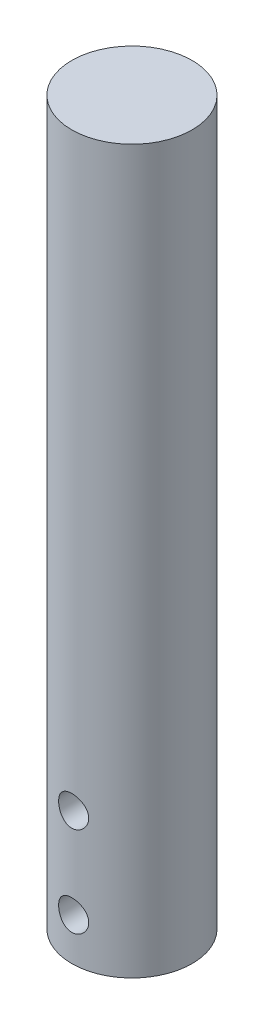
ISO-10303-21;
HEADER;
FILE_DESCRIPTION(('STEP AP214'),'2;1');
FILE_NAME('part.step','',(''),(''),'','','');
FILE_SCHEMA(('AUTOMOTIVE_DESIGN { 1 0 10303 214 1 1 1 1 }'));
ENDSEC;
DATA;
#1=APPLICATION_CONTEXT('core data for automotive mechanical design processes');
#2=APPLICATION_PROTOCOL_DEFINITION('international standard','automotive_design',2000,#1);
#3=PRODUCT_CONTEXT('',#1,'mechanical');
#4=PRODUCT('Part','Part','',(#3));
#5=PRODUCT_RELATED_PRODUCT_CATEGORY('part','',(#4));
#6=PRODUCT_DEFINITION_FORMATION('','',#4);
#7=PRODUCT_DEFINITION_CONTEXT('part definition',#1,'design');
#8=PRODUCT_DEFINITION('design','',#6,#7);
#9=PRODUCT_DEFINITION_SHAPE('','',#8);
#10=(LENGTH_UNIT() NAMED_UNIT(*) SI_UNIT(.MILLI.,.METRE.));
#11=(NAMED_UNIT(*) PLANE_ANGLE_UNIT() SI_UNIT($,.RADIAN.));
#12=(NAMED_UNIT(*) SI_UNIT($,.STERADIAN.) SOLID_ANGLE_UNIT());
#13=UNCERTAINTY_MEASURE_WITH_UNIT(LENGTH_MEASURE(1.E-05),#10,'distance_accuracy_value','');
#14=(GEOMETRIC_REPRESENTATION_CONTEXT(3) GLOBAL_UNCERTAINTY_ASSIGNED_CONTEXT((#13)) GLOBAL_UNIT_ASSIGNED_CONTEXT((#10,
#11,#12)) REPRESENTATION_CONTEXT('',''));
#15=CARTESIAN_POINT('',(0.,0.,0.));
#16=DIRECTION('',(0.,0.,1.));
#17=DIRECTION('',(1.,0.,0.));
#18=AXIS2_PLACEMENT_3D('',#15,#16,#17);
#19=CARTESIAN_POINT('',(0.,152.4,0.));
#20=DIRECTION('',(0.,-1.,0.));
#21=DIRECTION('',(0.,0.,-1.));
#22=AXIS2_PLACEMENT_3D('',#19,#20,#21);
#23=CYLINDRICAL_SURFACE('',#22,12.7);
#24=CARTESIAN_POINT('',(0.,12.065,-12.7));
#25=CARTESIAN_POINT('',(-0.175421054350929,12.0649950771876,-12.6999970338729));
#26=CARTESIAN_POINT('',(-0.350897100741778,12.0504128841955,-12.6963292371237));
#27=CARTESIAN_POINT('',(-0.696820051980957,11.9925567630668,-12.6820530760661));
#28=CARTESIAN_POINT('',(-0.86726404920973,11.9492665731449,-12.6714407780562));
#29=CARTESIAN_POINT('',(-1.19807751278645,11.8354702468386,-12.6444507573614));
#30=CARTESIAN_POINT('',(-1.35845880926017,11.7649967927193,-12.6280799601569));
#31=CARTESIAN_POINT('',(-1.66512267919771,11.5989493910717,-12.591316443928));
#32=CARTESIAN_POINT('',(-1.81140477687155,11.5033745968815,-12.5709235892463));
#33=CARTESIAN_POINT('',(-2.08873074612027,11.2877583285653,-12.5278602543575));
#34=CARTESIAN_POINT('',(-2.2194428772959,11.1672971663367,-12.5051546346353));
#35=CARTESIAN_POINT('',(-2.45903522924702,10.9062261662759,-12.4602582924963));
#36=CARTESIAN_POINT('',(-2.56791298487579,10.765614056429,-12.4380676284689));
#37=CARTESIAN_POINT('',(-2.76230618225783,10.4656567700734,-12.3963594189446));
#38=CARTESIAN_POINT('',(-2.84745052370821,10.3060643281215,-12.3768864828385));
#39=CARTESIAN_POINT('',(-2.98957345643241,9.97426586198626,-12.343330973648));
#40=CARTESIAN_POINT('',(-3.04655655068163,9.80206185944723,-12.3292475388652));
#41=CARTESIAN_POINT('',(-3.12960773790342,9.45357626213982,-12.3084267567388));
#42=CARTESIAN_POINT('',(-3.15627230130285,9.27744547005292,-12.3015478927701));
#43=CARTESIAN_POINT('',(-3.17978742389056,8.92308652895139,-12.2954915053947));
#44=CARTESIAN_POINT('',(-3.176642833515,8.74485872586831,-12.2963127290578));
#45=CARTESIAN_POINT('',(-3.14110481048737,8.39593654027233,-12.3054365167726));
#46=CARTESIAN_POINT('',(-3.10942215340351,8.22516426789838,-12.3135572669877));
#47=CARTESIAN_POINT('',(-3.01884119561133,7.89143910890492,-12.3360753547043));
#48=CARTESIAN_POINT('',(-2.95994095604688,7.72848678025545,-12.3504731393489));
#49=CARTESIAN_POINT('',(-2.81599106163371,7.41312119893299,-12.3840899110031));
#50=CARTESIAN_POINT('',(-2.73068344564301,7.26083093637874,-12.4033560981111));
#51=CARTESIAN_POINT('',(-2.53652078423163,6.97247206434806,-12.4445122129068));
#52=CARTESIAN_POINT('',(-2.42766161831204,6.83640629992432,-12.4664025994163));
#53=CARTESIAN_POINT('',(-2.18580424890858,6.58028568011351,-12.5111061380944));
#54=CARTESIAN_POINT('',(-2.05220624645107,6.46079799603681,-12.533927803951));
#55=CARTESIAN_POINT('',(-1.76659522538283,6.24581503678474,-12.5773596047503));
#56=CARTESIAN_POINT('',(-1.61458164448181,6.15032049447545,-12.5979696721291));
#57=CARTESIAN_POINT('',(-1.29564529770895,5.98582625915838,-12.6347586626604));
#58=CARTESIAN_POINT('',(-1.12867311562492,5.91691869646146,-12.6509221227036));
#59=CARTESIAN_POINT('',(-0.785020883902435,5.8083083695814,-12.676884242985));
#60=CARTESIAN_POINT('',(-0.608342698201859,5.76860001891494,-12.6866841206814));
#61=CARTESIAN_POINT('',(-0.255142937325557,5.72038148623379,-12.6986347345774));
#62=CARTESIAN_POINT('',(-0.0787330573083777,5.71109892814061,-12.7009747992585));
#63=CARTESIAN_POINT('',(0.273119584996527,5.72187705435078,-12.6982813685726));
#64=CARTESIAN_POINT('',(0.448562432914396,5.74193509725817,-12.6932485369526));
#65=CARTESIAN_POINT('',(0.79081686891024,5.81018842276175,-12.6764961338623));
#66=CARTESIAN_POINT('',(0.957717835150523,5.85796234102626,-12.6648767569325));
#67=CARTESIAN_POINT('',(1.28112793569116,5.97980999452691,-12.6362609570897));
#68=CARTESIAN_POINT('',(1.43763601861911,6.05388638579632,-12.6192639911647));
#69=CARTESIAN_POINT('',(1.73889063454314,6.2277331394514,-12.5813250177716));
#70=CARTESIAN_POINT('',(1.88337918521904,6.32793610457274,-12.5603183592593));
#71=CARTESIAN_POINT('',(2.15376466554501,6.55063864028733,-12.5167921111412));
#72=CARTESIAN_POINT('',(2.27965837982672,6.67314205885732,-12.4942722608556));
#73=CARTESIAN_POINT('',(2.51246336908675,6.94055415045254,-12.4495762556412));
#74=CARTESIAN_POINT('',(2.6188328531313,7.08593897134918,-12.4274221051899));
#75=CARTESIAN_POINT('',(2.80566443991221,7.39295074295838,-12.3865825924258));
#76=CARTESIAN_POINT('',(2.88612769264178,7.554576972287,-12.3678970761538));
#77=CARTESIAN_POINT('',(3.0182638402854,7.88861711242697,-12.3363163381503));
#78=CARTESIAN_POINT('',(3.07010730622843,8.06096014659597,-12.3233869021911));
#79=CARTESIAN_POINT('',(3.14398164687971,8.41228873345877,-12.3047494152553));
#80=CARTESIAN_POINT('',(3.16601904149253,8.59127282465607,-12.299039785006));
#81=CARTESIAN_POINT('',(3.17931501621074,8.9452895005204,-12.2956087422145));
#82=CARTESIAN_POINT('',(3.17143955029538,9.12028790438749,-12.2976625750886));
#83=CARTESIAN_POINT('',(3.1271152390873,9.46637656437626,-12.3090074061494));
#84=CARTESIAN_POINT('',(3.09066696801937,9.6374668989669,-12.3182982588945));
#85=CARTESIAN_POINT('',(2.9907046261569,9.96994123834368,-12.3429450180984));
#86=CARTESIAN_POINT('',(2.92735297324093,10.1313769627554,-12.3582644892528));
#87=CARTESIAN_POINT('',(2.7755107337966,10.4414433934137,-12.3932474960913));
#88=CARTESIAN_POINT('',(2.68701666057215,10.5900723199131,-12.4129116342002));
#89=CARTESIAN_POINT('',(2.48468673461549,10.8744906313868,-12.4550092586011));
#90=CARTESIAN_POINT('',(2.37025002816433,11.0098439387471,-12.4775016056118));
#91=CARTESIAN_POINT('',(2.12045416901821,11.2597079114838,-12.5223699100401));
#92=CARTESIAN_POINT('',(1.98509005500274,11.3742136204058,-12.5447458385544));
#93=CARTESIAN_POINT('',(1.6943230585205,11.5811539364617,-12.5873437112106));
#94=CARTESIAN_POINT('',(1.53860166056969,11.6731512656048,-12.6075193062447));
#95=CARTESIAN_POINT('',(1.21341315929717,11.8295154632241,-12.6429542453062));
#96=CARTESIAN_POINT('',(1.04395600927443,11.8939021300394,-12.6582171100619));
#97=CARTESIAN_POINT('',(0.729001702698678,11.9836603741978,-12.6798505941374));
#98=CARTESIAN_POINT('',(0.585004695088741,12.0140967977964,-12.6873547169486));
#99=CARTESIAN_POINT('',(0.294017851418463,12.0547679139998,-12.6974304774096));
#100=CARTESIAN_POINT('',(0.14702824129687,12.0650041260296,-12.7000024860439));
#101=CARTESIAN_POINT('',(0.,12.065,-12.7));
#102=B_SPLINE_CURVE_WITH_KNOTS('',3,(#24,#25,#26,#27,#28,#29,#30,#31,#32,#33,#34,#35,#36,#37,
#38,#39,#40,#41,#42,#43,#44,#45,#46,#47,#48,#49,#50,#51,#52,#53,#54,#55,#56,#57,#58,#59,#60,#61,
#62,#63,#64,#65,#66,#67,#68,#69,#70,#71,#72,#73,#74,#75,#76,#77,#78,#79,#80,#81,#82,#83,#84,#85,
#86,#87,#88,#89,#90,#91,#92,#93,#94,#95,#96,#97,#98,#99,#100,#101),.UNSPECIFIED.,.T.,.F.,(4,2,2,
2,2,2,2,2,2,2,2,2,2,2,2,2,2,2,2,2,2,2,2,2,2,2,2,2,2,2,2,2,2,2,2,2,2,2,4),(0.,0.525724358065498,
1.05174676993359,1.57713870983893,2.10254837335841,2.63767221675278,3.17285644277798,
3.71599137305291,4.25903942808497,4.79120824630598,5.32329047345571,5.84247618671884,
6.36169889010144,6.8861628400674,7.41071862276907,7.9502317705812,8.48976139571985,
9.0311441807632,9.57242335981323,10.09985087283,10.6272309069567,11.1467958106174,
11.6664131950588,12.1952509368702,12.7241800170734,13.266092111565,13.8079801469349,
14.34660272276,14.8851074589671,15.4081433519175,15.9311687337377,16.4510804786766,
16.9710643590661,17.5046127008448,18.0382877269755,18.5816279265763,19.1245778677202,
19.5652441424438,20.005877269746),.UNSPECIFIED.);
#103=CARTESIAN_POINT('',(0.,12.065,-12.7));
#104=VERTEX_POINT('',#103);
#105=EDGE_CURVE('E10',#104,#104,#102,.T.);
#106=ORIENTED_EDGE('',*,*,#105,.T.);
#107=EDGE_LOOP('',(#106));
#108=FACE_BOUND('',#107,.T.);
#109=CARTESIAN_POINT('',(3.175,8.89,12.2967221242086));
#110=CARTESIAN_POINT('',(3.1749950198132,8.71467554632325,12.2967254711158));
#111=CARTESIAN_POINT('',(3.16042833178202,8.53929597867828,12.3005126863854));
#112=CARTESIAN_POINT('',(3.10263936933902,8.19357317571964,12.3152136473056));
#113=CARTESIAN_POINT('',(3.05940041756247,8.0232329318254,12.3261315404947));
#114=CARTESIAN_POINT('',(2.94575382353269,7.69263950650228,12.3537818023711));
#115=CARTESIAN_POINT('',(2.8753812543752,7.53237361266015,12.3705066621688));
#116=CARTESIAN_POINT('',(2.70957184940196,7.22590521727435,12.4078770387652));
#117=CARTESIAN_POINT('',(2.61413394947207,7.07970331315812,12.4285227220068));
#118=CARTESIAN_POINT('',(2.39865970268609,6.80229571051699,12.4719170977164));
#119=CARTESIAN_POINT('',(2.27817284738415,6.67144512755544,12.4946993898125));
#120=CARTESIAN_POINT('',(2.01699122140784,6.43158302916237,12.5395085190442));
#121=CARTESIAN_POINT('',(1.87629456360899,6.32257355546038,12.5615352853931));
#122=CARTESIAN_POINT('',(1.57625440537028,6.12803515610828,12.6027232771114));
#123=CARTESIAN_POINT('',(1.41667811176781,6.04285508703494,12.6218402299875));
#124=CARTESIAN_POINT('',(1.08491424405181,5.90066175192559,12.65467131146));
#125=CARTESIAN_POINT('',(0.912728534955768,5.8436443300673,12.6683862371462));
#126=CARTESIAN_POINT('',(0.56433562361779,5.7605322500852,12.6886304373719));
#127=CARTESIAN_POINT('',(0.388280553827203,5.73383455170524,12.6952996518228));
#128=CARTESIAN_POINT('',(0.0340726004637216,5.71022685832005,12.7011886451627));
#129=CARTESIAN_POINT('',(-0.144079969063343,5.71331245929381,12.7004095254282));
#130=CARTESIAN_POINT('',(-0.493243384772326,5.74875005981768,12.6915938059099));
#131=CARTESIAN_POINT('',(-0.664324984533384,5.7804511328184,12.6837186297291));
#132=CARTESIAN_POINT('',(-0.998658935538451,5.87117351296159,12.6617836238657));
#133=CARTESIAN_POINT('',(-1.16191086950114,5.93019627442931,12.6477234649603));
#134=CARTESIAN_POINT('',(-1.47766628361823,6.07441326477257,12.6147513732012));
#135=CARTESIAN_POINT('',(-1.63005931850865,6.15983914672041,12.5957967501266));
#136=CARTESIAN_POINT('',(-1.91857510093105,6.35426171247765,12.5550917783831));
#137=CARTESIAN_POINT('',(-2.05469501139648,6.46326249707199,12.5333409435887));
#138=CARTESIAN_POINT('',(-2.31068256139473,6.70523010231761,12.4887191648708));
#139=CARTESIAN_POINT('',(-2.43001063106375,6.83876571328163,12.4658338379713));
#140=CARTESIAN_POINT('',(-2.64469999368259,7.12419196639615,12.4220610526701));
#141=CARTESIAN_POINT('',(-2.74006016644614,7.2760834659537,12.4011736876753));
#142=CARTESIAN_POINT('',(-2.90445230964671,7.59496834336905,12.3637103097324));
#143=CARTESIAN_POINT('',(-2.97335437513118,7.76203137749726,12.347155693206));
#144=CARTESIAN_POINT('',(-3.08192684552051,8.10588354445759,12.3205067298881));
#145=CARTESIAN_POINT('',(-3.12160350580598,8.28267058726043,12.3104110007027));
#146=CARTESIAN_POINT('',(-3.16970364110572,8.63594856694299,12.2981130212947));
#147=CARTESIAN_POINT('',(-3.17892490187728,8.8123239975431,12.2957093300071));
#148=CARTESIAN_POINT('',(-3.16803657795425,9.16409385946326,12.2985192607316));
#149=CARTESIAN_POINT('',(-3.14792969326925,9.33948837959578,12.3037321815428));
#150=CARTESIAN_POINT('',(-3.07965533920158,9.68135511648468,12.3209949412092));
#151=CARTESIAN_POINT('',(-3.03195236671802,9.84792636274288,12.3329315220802));
#152=CARTESIAN_POINT('',(-2.91035496372149,10.1707079514737,12.3621891219376));
#153=CARTESIAN_POINT('',(-2.83645743059488,10.3269170640008,12.3795107787294));
#154=CARTESIAN_POINT('',(-2.66289874827949,10.627920422891,12.418010941113));
#155=CARTESIAN_POINT('',(-2.56276062737127,10.7724306268546,12.439258441312));
#156=CARTESIAN_POINT('',(-2.34016643006689,11.0428892207579,12.4830469550031));
#157=CARTESIAN_POINT('',(-2.21770668600727,11.1688345541456,12.5055881806495));
#158=CARTESIAN_POINT('',(-1.95028413912651,11.4018200240651,12.5501070185035));
#159=CARTESIAN_POINT('',(-1.80483494928781,11.508308279437,12.5720564161859));
#160=CARTESIAN_POINT('',(-1.4976560175556,11.6953485510281,12.6123346509939));
#161=CARTESIAN_POINT('',(-1.33592712544035,11.7759019200924,12.6306636769502));
#162=CARTESIAN_POINT('',(-1.00189729049622,11.9080864638505,12.6615204698767));
#163=CARTESIAN_POINT('',(-0.829682684763529,11.9599256411614,12.6740898412846));
#164=CARTESIAN_POINT('',(-0.478630489012215,12.0338346249527,12.6921932261265));
#165=CARTESIAN_POINT('',(-0.299794184005942,12.0559101765986,12.6977285972965));
#166=CARTESIAN_POINT('',(0.0542401964575483,12.0693420969023,12.7010848787296));
#167=CARTESIAN_POINT('',(0.229405900617116,12.0615129263779,12.6991103294396));
#168=CARTESIAN_POINT('',(0.575841801116831,12.0172231483404,12.6881222125238));
#169=CARTESIAN_POINT('',(0.747112113154445,11.9807633923332,12.6791088542401));
#170=CARTESIAN_POINT('',(1.08004303817215,11.8806842022275,12.655087493111));
#171=CARTESIAN_POINT('',(1.24175042029423,11.8172120357268,12.640112022951));
#172=CARTESIAN_POINT('',(1.55231164340715,11.6650434116129,12.6057434230086));
#173=CARTESIAN_POINT('',(1.70116386101838,11.5763437742712,12.5863497364056));
#174=CARTESIAN_POINT('',(1.98565112274398,11.3737541320623,12.5446551773491));
#175=CARTESIAN_POINT('',(2.12088408784721,11.2593115462803,12.5222957878979));
#176=CARTESIAN_POINT('',(2.37050268936837,11.0095574449719,12.4774531075658));
#177=CARTESIAN_POINT('',(2.48488303211817,10.8742406463471,12.4549697867119));
#178=CARTESIAN_POINT('',(2.69164443404806,10.5835405099485,12.4119473580947));
#179=CARTESIAN_POINT('',(2.783575266647,10.4278299083153,12.3914523466269));
#180=CARTESIAN_POINT('',(2.93981789665886,10.1026738196475,12.3553205869608));
#181=CARTESIAN_POINT('',(3.00414978846308,9.93323843265204,12.3396803064045));
#182=CARTESIAN_POINT('',(3.09379152821293,9.61841798742337,12.3174731028359));
#183=CARTESIAN_POINT('',(3.12417831664509,9.47453920307402,12.3097500503611));
#184=CARTESIAN_POINT('',(3.16478377891537,9.18378634093234,12.2993733749982));
#185=CARTESIAN_POINT('',(3.17500417313031,9.03691251972402,12.2967193196792));
#186=CARTESIAN_POINT('',(3.175,8.89,12.2967221242086));
#187=B_SPLINE_CURVE_WITH_KNOTS('',3,(#109,#110,#111,#112,#113,#114,#115,#116,#117,#118,#119,
#120,#121,#122,#123,#124,#125,#126,#127,#128,#129,#130,#131,#132,#133,#134,#135,#136,#137,#138,
#139,#140,#141,#142,#143,#144,#145,#146,#147,#148,#149,#150,#151,#152,#153,#154,#155,#156,#157,
#158,#159,#160,#161,#162,#163,#164,#165,#166,#167,#168,#169,#170,#171,#172,#173,#174,#175,#176,
#177,#178,#179,#180,#181,#182,#183,#184,#185,#186),.UNSPECIFIED.,.T.,.F.,(4,2,2,2,2,2,2,2,2,2,2,
2,2,2,2,2,2,2,2,2,2,2,2,2,2,2,2,2,2,2,2,2,2,2,2,2,2,2,4),(0.,0.525433851004891,1.05117359161441,
1.57623602350085,2.10132074979458,2.63682421825079,3.1723777227943,3.71540400425358,
4.25835013005807,4.79029713764089,5.32216548805845,5.84223193614962,6.36232607040478,
6.88711950303144,7.41200429545519,7.95109492546327,8.49021074623748,9.03194068650671,
9.57355464164525,10.1008633995054,10.6281236152971,11.1467570436797,11.6654519221148,
12.1943221424741,12.7232793399029,13.2654717033223,13.8076357797011,14.3458193247108,
14.8838989712076,15.4074297658815,15.9309449907505,16.4516419323711,16.9724045329363,
17.5056431266551,18.0390169009448,18.5823412615974,19.1252693614627,19.5655924052587,
20.0058778838705),.UNSPECIFIED.);
#188=CARTESIAN_POINT('',(3.175,8.89,12.2967221242086));
#189=VERTEX_POINT('',#188);
#190=EDGE_CURVE('E41',#189,#189,#187,.T.);
#191=ORIENTED_EDGE('',*,*,#190,.T.);
#192=EDGE_LOOP('',(#191));
#193=FACE_BOUND('',#192,.T.);
#194=CARTESIAN_POINT('',(0.,31.115,-12.7));
#195=CARTESIAN_POINT('',(-0.175421054350931,31.1149950771876,-12.6999970338729));
#196=CARTESIAN_POINT('',(-0.350897100741782,31.1004128841955,-12.6963292371237));
#197=CARTESIAN_POINT('',(-0.696820051980961,31.0425567630668,-12.6820530760661));
#198=CARTESIAN_POINT('',(-0.867264049209732,30.9992665731449,-12.6714407780562));
#199=CARTESIAN_POINT('',(-1.19807751278645,30.8854702468386,-12.6444507573614));
#200=CARTESIAN_POINT('',(-1.35845880926017,30.8149967927193,-12.6280799601569));
#201=CARTESIAN_POINT('',(-1.6651226791977,30.6489493910718,-12.591316443928));
#202=CARTESIAN_POINT('',(-1.81140477687155,30.5533745968815,-12.5709235892463));
#203=CARTESIAN_POINT('',(-2.08873074612027,30.3377583285653,-12.5278602543575));
#204=CARTESIAN_POINT('',(-2.2194428772959,30.2172971663367,-12.5051546346353));
#205=CARTESIAN_POINT('',(-2.45903522924702,29.9562261662759,-12.4602582924963));
#206=CARTESIAN_POINT('',(-2.56791298487579,29.815614056429,-12.4380676284689));
#207=CARTESIAN_POINT('',(-2.76230618225783,29.5156567700734,-12.3963594189446));
#208=CARTESIAN_POINT('',(-2.84745052370821,29.3560643281215,-12.3768864828385));
#209=CARTESIAN_POINT('',(-2.98957345643241,29.0242658619863,-12.343330973648));
#210=CARTESIAN_POINT('',(-3.04655655068163,28.8520618594472,-12.3292475388652));
#211=CARTESIAN_POINT('',(-3.12960773790342,28.5035762621398,-12.3084267567388));
#212=CARTESIAN_POINT('',(-3.15627230130284,28.3274454700529,-12.3015478927701));
#213=CARTESIAN_POINT('',(-3.17978742389056,27.9730865289514,-12.2954915053947));
#214=CARTESIAN_POINT('',(-3.176642833515,27.7948587258683,-12.2963127290578));
#215=CARTESIAN_POINT('',(-3.14110481048737,27.4459365402723,-12.3054365167726));
#216=CARTESIAN_POINT('',(-3.10942215340351,27.2751642678984,-12.3135572669877));
#217=CARTESIAN_POINT('',(-3.01884119561133,26.9414391089049,-12.3360753547043));
#218=CARTESIAN_POINT('',(-2.95994095604688,26.7784867802555,-12.3504731393489));
#219=CARTESIAN_POINT('',(-2.81599106163371,26.463121198933,-12.3840899110031));
#220=CARTESIAN_POINT('',(-2.73068344564301,26.3108309363787,-12.4033560981111));
#221=CARTESIAN_POINT('',(-2.53652078423164,26.0224720643481,-12.4445122129068));
#222=CARTESIAN_POINT('',(-2.42766161831204,25.8864062999243,-12.4664025994163));
#223=CARTESIAN_POINT('',(-2.18580424890858,25.6302856801135,-12.5111061380944));
#224=CARTESIAN_POINT('',(-2.05220624645107,25.5107979960368,-12.533927803951));
#225=CARTESIAN_POINT('',(-1.76659522538283,25.2958150367847,-12.5773596047503));
#226=CARTESIAN_POINT('',(-1.61458164448182,25.2003204944755,-12.5979696721291));
#227=CARTESIAN_POINT('',(-1.29564529770895,25.0358262591584,-12.6347586626604));
#228=CARTESIAN_POINT('',(-1.12867311562492,24.9669186964615,-12.6509221227036));
#229=CARTESIAN_POINT('',(-0.785020883902437,24.8583083695814,-12.676884242985));
#230=CARTESIAN_POINT('',(-0.608342698201861,24.8186000189149,-12.6866841206814));
#231=CARTESIAN_POINT('',(-0.255142937325558,24.7703814862338,-12.6986347345774));
#232=CARTESIAN_POINT('',(-0.0787330573083791,24.7610989281406,-12.7009747992585));
#233=CARTESIAN_POINT('',(0.273119584996525,24.7718770543508,-12.6982813685726));
#234=CARTESIAN_POINT('',(0.448562432914395,24.7919350972582,-12.6932485369526));
#235=CARTESIAN_POINT('',(0.790816868910238,24.8601884227617,-12.6764961338623));
#236=CARTESIAN_POINT('',(0.957717835150521,24.9079623410263,-12.6648767569325));
#237=CARTESIAN_POINT('',(1.28112793569116,25.0298099945269,-12.6362609570897));
#238=CARTESIAN_POINT('',(1.43763601861911,25.1038863857963,-12.6192639911647));
#239=CARTESIAN_POINT('',(1.73889063454314,25.2777331394514,-12.5813250177716));
#240=CARTESIAN_POINT('',(1.88337918521904,25.3779361045727,-12.5603183592593));
#241=CARTESIAN_POINT('',(2.15376466554501,25.6006386402873,-12.5167921111412));
#242=CARTESIAN_POINT('',(2.27965837982672,25.7231420588573,-12.4942722608556));
#243=CARTESIAN_POINT('',(2.51246336908675,25.9905541504525,-12.4495762556412));
#244=CARTESIAN_POINT('',(2.6188328531313,26.1359389713492,-12.4274221051899));
#245=CARTESIAN_POINT('',(2.80566443991221,26.4429507429584,-12.3865825924258));
#246=CARTESIAN_POINT('',(2.88612769264178,26.604576972287,-12.3678970761538));
#247=CARTESIAN_POINT('',(3.0182638402854,26.938617112427,-12.3363163381503));
#248=CARTESIAN_POINT('',(3.07010730622843,27.110960146596,-12.3233869021911));
#249=CARTESIAN_POINT('',(3.14398164687971,27.4622887334588,-12.3047494152553));
#250=CARTESIAN_POINT('',(3.16601904149253,27.6412728246561,-12.299039785006));
#251=CARTESIAN_POINT('',(3.17931501621074,27.9952895005204,-12.2956087422145));
#252=CARTESIAN_POINT('',(3.17143955029538,28.1702879043875,-12.2976625750886));
#253=CARTESIAN_POINT('',(3.1271152390873,28.5163765643763,-12.3090074061494));
#254=CARTESIAN_POINT('',(3.09066696801937,28.6874668989669,-12.3182982588945));
#255=CARTESIAN_POINT('',(2.9907046261569,29.0199412383437,-12.3429450180984));
#256=CARTESIAN_POINT('',(2.92735297324093,29.1813769627554,-12.3582644892528));
#257=CARTESIAN_POINT('',(2.7755107337966,29.4914433934137,-12.3932474960913));
#258=CARTESIAN_POINT('',(2.68701666057215,29.6400723199131,-12.4129116342002));
#259=CARTESIAN_POINT('',(2.48468673461549,29.9244906313868,-12.4550092586011));
#260=CARTESIAN_POINT('',(2.37025002816433,30.0598439387472,-12.4775016056118));
#261=CARTESIAN_POINT('',(2.12045416901821,30.3097079114838,-12.5223699100401));
#262=CARTESIAN_POINT('',(1.98509005500274,30.4242136204058,-12.5447458385544));
#263=CARTESIAN_POINT('',(1.6943230585205,30.6311539364617,-12.5873437112106));
#264=CARTESIAN_POINT('',(1.53860166056969,30.7231512656048,-12.6075193062447));
#265=CARTESIAN_POINT('',(1.21341315929717,30.8795154632241,-12.6429542453062));
#266=CARTESIAN_POINT('',(1.04395600927443,30.9439021300394,-12.6582171100619));
#267=CARTESIAN_POINT('',(0.72900170269868,31.0336603741978,-12.6798505941374));
#268=CARTESIAN_POINT('',(0.585004695088744,31.0640967977964,-12.6873547169486));
#269=CARTESIAN_POINT('',(0.294017851418466,31.1047679139998,-12.6974304774096));
#270=CARTESIAN_POINT('',(0.147028241296871,31.1150041260296,-12.7000024860439));
#271=CARTESIAN_POINT('',(0.,31.115,-12.7));
#272=B_SPLINE_CURVE_WITH_KNOTS('',3,(#194,#195,#196,#197,#198,#199,#200,#201,#202,#203,#204,
#205,#206,#207,#208,#209,#210,#211,#212,#213,#214,#215,#216,#217,#218,#219,#220,#221,#222,#223,
#224,#225,#226,#227,#228,#229,#230,#231,#232,#233,#234,#235,#236,#237,#238,#239,#240,#241,#242,
#243,#244,#245,#246,#247,#248,#249,#250,#251,#252,#253,#254,#255,#256,#257,#258,#259,#260,#261,
#262,#263,#264,#265,#266,#267,#268,#269,#270,#271),.UNSPECIFIED.,.T.,.F.,(4,2,2,2,2,2,2,2,2,2,2,
2,2,2,2,2,2,2,2,2,2,2,2,2,2,2,2,2,2,2,2,2,2,2,2,2,2,2,4),(0.,0.5257243580655,1.05174676993359,
1.57713870983892,2.10254837335841,2.63767221675277,3.17285644277797,3.71599137305291,
4.25903942808496,4.79120824630597,5.3232904734557,5.84247618671884,6.36169889010143,
6.8861628400674,7.41071862276906,7.95023177058119,8.48976139571985,9.0311441807632,
9.57242335981323,10.09985087283,10.6272309069567,11.1467958106174,11.6664131950588,
12.1952509368702,12.7241800170734,13.266092111565,13.8079801469349,14.34660272276,
14.885107458967,15.4081433519175,15.9311687337377,16.4510804786766,16.9710643590661,
17.5046127008447,18.0382877269755,18.5816279265763,19.1245778677202,19.5652441424438,
20.005877269746),.UNSPECIFIED.);
#273=CARTESIAN_POINT('',(0.,31.115,-12.7));
#274=VERTEX_POINT('',#273);
#275=EDGE_CURVE('E45',#274,#274,#272,.T.);
#276=ORIENTED_EDGE('',*,*,#275,.T.);
#277=EDGE_LOOP('',(#276));
#278=FACE_BOUND('',#277,.T.);
#279=CARTESIAN_POINT('',(3.175,27.94,12.2967221242086));
#280=CARTESIAN_POINT('',(3.1749950198132,27.7646755463232,12.2967254711158));
#281=CARTESIAN_POINT('',(3.16042833178202,27.5892959786783,12.3005126863854));
#282=CARTESIAN_POINT('',(3.10263936933902,27.2435731757196,12.3152136473056));
#283=CARTESIAN_POINT('',(3.05940041756247,27.0732329318254,12.3261315404947));
#284=CARTESIAN_POINT('',(2.94575382353269,26.7426395065023,12.3537818023711));
#285=CARTESIAN_POINT('',(2.8753812543752,26.5823736126602,12.3705066621688));
#286=CARTESIAN_POINT('',(2.70957184940196,26.2759052172743,12.4078770387652));
#287=CARTESIAN_POINT('',(2.61413394947207,26.1297033131581,12.4285227220068));
#288=CARTESIAN_POINT('',(2.39865970268609,25.852295710517,12.4719170977164));
#289=CARTESIAN_POINT('',(2.27817284738414,25.7214451275554,12.4946993898125));
#290=CARTESIAN_POINT('',(2.01699122140784,25.4815830291624,12.5395085190442));
#291=CARTESIAN_POINT('',(1.87629456360899,25.3725735554604,12.5615352853931));
#292=CARTESIAN_POINT('',(1.57625440537027,25.1780351561083,12.6027232771114));
#293=CARTESIAN_POINT('',(1.4166781117678,25.0928550870349,12.6218402299875));
#294=CARTESIAN_POINT('',(1.08491424405181,24.9506617519256,12.65467131146));
#295=CARTESIAN_POINT('',(0.912728534955765,24.8936443300673,12.6683862371462));
#296=CARTESIAN_POINT('',(0.564335623617785,24.8105322500852,12.6886304373719));
#297=CARTESIAN_POINT('',(0.388280553827198,24.7838345517052,12.6952996518228));
#298=CARTESIAN_POINT('',(0.0340726004637162,24.76022685832,12.7011886451627));
#299=CARTESIAN_POINT('',(-0.144079969063348,24.7633124592938,12.7004095254282));
#300=CARTESIAN_POINT('',(-0.493243384772331,24.7987500598177,12.6915938059099));
#301=CARTESIAN_POINT('',(-0.664324984533389,24.8304511328184,12.6837186297291));
#302=CARTESIAN_POINT('',(-0.998658935538456,24.9211735129616,12.6617836238657));
#303=CARTESIAN_POINT('',(-1.16191086950114,24.9801962744293,12.6477234649603));
#304=CARTESIAN_POINT('',(-1.47766628361824,25.1244132647726,12.6147513732012));
#305=CARTESIAN_POINT('',(-1.63005931850865,25.2098391467204,12.5957967501266));
#306=CARTESIAN_POINT('',(-1.91857510093106,25.4042617124777,12.5550917783831));
#307=CARTESIAN_POINT('',(-2.05469501139649,25.513262497072,12.5333409435887));
#308=CARTESIAN_POINT('',(-2.31068256139474,25.7552301023176,12.4887191648708));
#309=CARTESIAN_POINT('',(-2.43001063106375,25.8887657132816,12.4658338379713));
#310=CARTESIAN_POINT('',(-2.6446999936826,26.1741919663962,12.4220610526701));
#311=CARTESIAN_POINT('',(-2.74006016644614,26.3260834659537,12.4011736876753));
#312=CARTESIAN_POINT('',(-2.90445230964671,26.6449683433691,12.3637103097324));
#313=CARTESIAN_POINT('',(-2.97335437513118,26.8120313774973,12.347155693206));
#314=CARTESIAN_POINT('',(-3.08192684552051,27.1558835444576,12.3205067298881));
#315=CARTESIAN_POINT('',(-3.12160350580598,27.3326705872604,12.3104110007027));
#316=CARTESIAN_POINT('',(-3.16970364110572,27.685948566943,12.2981130212947));
#317=CARTESIAN_POINT('',(-3.17892490187728,27.8623239975431,12.2957093300071));
#318=CARTESIAN_POINT('',(-3.16803657795425,28.2140938594633,12.2985192607316));
#319=CARTESIAN_POINT('',(-3.14792969326925,28.3894883795958,12.3037321815428));
#320=CARTESIAN_POINT('',(-3.07965533920158,28.7313551164847,12.3209949412092));
#321=CARTESIAN_POINT('',(-3.03195236671802,28.8979263627429,12.3329315220802));
#322=CARTESIAN_POINT('',(-2.91035496372149,29.2207079514737,12.3621891219376));
#323=CARTESIAN_POINT('',(-2.83645743059488,29.3769170640008,12.3795107787294));
#324=CARTESIAN_POINT('',(-2.66289874827948,29.677920422891,12.418010941113));
#325=CARTESIAN_POINT('',(-2.56276062737126,29.8224306268546,12.439258441312));
#326=CARTESIAN_POINT('',(-2.34016643006688,30.0928892207579,12.4830469550031));
#327=CARTESIAN_POINT('',(-2.21770668600726,30.2188345541456,12.5055881806495));
#328=CARTESIAN_POINT('',(-1.9502841391265,30.4518200240651,12.5501070185035));
#329=CARTESIAN_POINT('',(-1.8048349492878,30.558308279437,12.5720564161859));
#330=CARTESIAN_POINT('',(-1.49765601755559,30.7453485510281,12.6123346509939));
#331=CARTESIAN_POINT('',(-1.33592712544035,30.8259019200924,12.6306636769502));
#332=CARTESIAN_POINT('',(-1.00189729049621,30.9580864638505,12.6615204698767));
#333=CARTESIAN_POINT('',(-0.829682684763523,31.0099256411614,12.6740898412846));
#334=CARTESIAN_POINT('',(-0.478630489012209,31.0838346249527,12.6921932261265));
#335=CARTESIAN_POINT('',(-0.299794184005935,31.1059101765986,12.6977285972965));
#336=CARTESIAN_POINT('',(0.0542401964575544,31.1193420969023,12.7010848787296));
#337=CARTESIAN_POINT('',(0.229405900617123,31.1115129263779,12.6991103294396));
#338=CARTESIAN_POINT('',(0.575841801116838,31.0672231483404,12.6881222125238));
#339=CARTESIAN_POINT('',(0.747112113154452,31.0307633923332,12.6791088542401));
#340=CARTESIAN_POINT('',(1.08004303817216,30.9306842022275,12.655087493111));
#341=CARTESIAN_POINT('',(1.24175042029424,30.8672120357268,12.640112022951));
#342=CARTESIAN_POINT('',(1.55231164340716,30.7150434116129,12.6057434230086));
#343=CARTESIAN_POINT('',(1.70116386101839,30.6263437742712,12.5863497364056));
#344=CARTESIAN_POINT('',(1.98565112274399,30.4237541320623,12.5446551773491));
#345=CARTESIAN_POINT('',(2.12088408784722,30.3093115462803,12.5222957878979));
#346=CARTESIAN_POINT('',(2.37050268936838,30.0595574449719,12.4774531075658));
#347=CARTESIAN_POINT('',(2.48488303211818,29.9242406463471,12.4549697867118));
#348=CARTESIAN_POINT('',(2.69164443404807,29.6335405099485,12.4119473580947));
#349=CARTESIAN_POINT('',(2.783575266647,29.4778299083153,12.3914523466269));
#350=CARTESIAN_POINT('',(2.93981789665887,29.1526738196474,12.3553205869608));
#351=CARTESIAN_POINT('',(3.00414978846309,28.983238432652,12.3396803064045));
#352=CARTESIAN_POINT('',(3.09379152821293,28.6684179874234,12.3174731028359));
#353=CARTESIAN_POINT('',(3.12417831664509,28.524539203074,12.3097500503611));
#354=CARTESIAN_POINT('',(3.16478377891537,28.2337863409323,12.2993733749982));
#355=CARTESIAN_POINT('',(3.17500417313031,28.086912519724,12.2967193196792));
#356=CARTESIAN_POINT('',(3.175,27.94,12.2967221242086));
#357=B_SPLINE_CURVE_WITH_KNOTS('',3,(#279,#280,#281,#282,#283,#284,#285,#286,#287,#288,#289,
#290,#291,#292,#293,#294,#295,#296,#297,#298,#299,#300,#301,#302,#303,#304,#305,#306,#307,#308,
#309,#310,#311,#312,#313,#314,#315,#316,#317,#318,#319,#320,#321,#322,#323,#324,#325,#326,#327,
#328,#329,#330,#331,#332,#333,#334,#335,#336,#337,#338,#339,#340,#341,#342,#343,#344,#345,#346,
#347,#348,#349,#350,#351,#352,#353,#354,#355,#356),.UNSPECIFIED.,.T.,.F.,(4,2,2,2,2,2,2,2,2,2,2,
2,2,2,2,2,2,2,2,2,2,2,2,2,2,2,2,2,2,2,2,2,2,2,2,2,2,2,4),(0.,0.525433851004893,1.05117359161441,
1.57623602350085,2.10132074979458,2.6368242182508,3.1723777227943,3.71540400425358,
4.25835013005807,4.7902971376409,5.32216548805846,5.84223193614963,6.36232607040478,
6.88711950303145,7.4120042954552,7.95109492546328,8.49021074623749,9.03194068650672,
9.57355464164526,10.1008633995054,10.6281236152971,11.1467570436797,11.6654519221148,
12.1943221424741,12.7232793399029,13.2654717033224,13.8076357797011,14.3458193247108,
14.8838989712076,15.4074297658815,15.9309449907505,16.4516419323711,16.9724045329363,
17.5056431266551,18.0390169009448,18.5823412615974,19.1252693614627,19.5655924052587,
20.0058778838705),.UNSPECIFIED.);
#358=CARTESIAN_POINT('',(3.175,27.94,12.2967221242086));
#359=VERTEX_POINT('',#358);
#360=EDGE_CURVE('E49',#359,#359,#357,.T.);
#361=ORIENTED_EDGE('',*,*,#360,.T.);
#362=EDGE_LOOP('',(#361));
#363=FACE_BOUND('',#362,.T.);
#364=CARTESIAN_POINT('',(0.,152.4,0.));
#365=DIRECTION('',(0.,1.,0.));
#366=DIRECTION('',(0.,0.,1.));
#367=AXIS2_PLACEMENT_3D('',#364,#365,#366);
#368=CIRCLE('',#367,12.7);
#369=CARTESIAN_POINT('',(0.,152.4,12.7));
#370=VERTEX_POINT('',#369);
#371=EDGE_CURVE('E74',#370,#370,#368,.T.);
#372=ORIENTED_EDGE('',*,*,#371,.F.);
#373=EDGE_LOOP('',(#372));
#374=FACE_BOUND('',#373,.T.);
#375=CARTESIAN_POINT('',(0.,0.,0.));
#376=DIRECTION('',(0.,1.,0.));
#377=DIRECTION('',(0.,0.,1.));
#378=AXIS2_PLACEMENT_3D('',#375,#376,#377);
#379=CIRCLE('',#378,12.7);
#380=CARTESIAN_POINT('',(0.,0.,12.7));
#381=VERTEX_POINT('',#380);
#382=EDGE_CURVE('E75',#381,#381,#379,.T.);
#383=ORIENTED_EDGE('',*,*,#382,.T.);
#384=EDGE_LOOP('',(#383));
#385=FACE_BOUND('',#384,.T.);
#386=ADVANCED_FACE('F31',(#108,#193,#278,#363,#374,#385),#23,.T.);
#387=CARTESIAN_POINT('',(0.,152.4,0.));
#388=DIRECTION('',(0.,1.,0.));
#389=DIRECTION('',(0.,0.,1.));
#390=AXIS2_PLACEMENT_3D('',#387,#388,#389);
#391=PLANE('',#390);
#392=ORIENTED_EDGE('',*,*,#371,.T.);
#393=EDGE_LOOP('',(#392));
#394=FACE_BOUND('',#393,.T.);
#395=ADVANCED_FACE('F68',(#394),#391,.T.);
#396=CARTESIAN_POINT('',(0.,0.,0.));
#397=DIRECTION('',(0.,1.,0.));
#398=DIRECTION('',(0.,0.,1.));
#399=AXIS2_PLACEMENT_3D('',#396,#397,#398);
#400=PLANE('',#399);
#401=ORIENTED_EDGE('',*,*,#382,.F.);
#402=EDGE_LOOP('',(#401));
#403=FACE_BOUND('',#402,.T.);
#404=ADVANCED_FACE('F66',(#403),#400,.F.);
#405=CARTESIAN_POINT('',(0.,27.94,-12.7));
#406=DIRECTION('',(0.,0.,1.));
#407=DIRECTION('',(1.,0.,0.));
#408=AXIS2_PLACEMENT_3D('',#405,#406,#407);
#409=CYLINDRICAL_SURFACE('',#408,3.175);
#410=ORIENTED_EDGE('',*,*,#360,.F.);
#411=EDGE_LOOP('',(#410));
#412=FACE_BOUND('',#411,.T.);
#413=ORIENTED_EDGE('',*,*,#275,.F.);
#414=EDGE_LOOP('',(#413));
#415=FACE_BOUND('',#414,.T.);
#416=ADVANCED_FACE('F60',(#412,#415),#409,.F.);
#417=CARTESIAN_POINT('',(0.,8.89,-12.7));
#418=DIRECTION('',(0.,0.,1.));
#419=DIRECTION('',(1.,0.,0.));
#420=AXIS2_PLACEMENT_3D('',#417,#418,#419);
#421=CYLINDRICAL_SURFACE('',#420,3.175);
#422=ORIENTED_EDGE('',*,*,#190,.F.);
#423=EDGE_LOOP('',(#422));
#424=FACE_BOUND('',#423,.T.);
#425=ORIENTED_EDGE('',*,*,#105,.F.);
#426=EDGE_LOOP('',(#425));
#427=FACE_BOUND('',#426,.T.);
#428=ADVANCED_FACE('F57',(#424,#427),#421,.F.);
#429=CLOSED_SHELL('',(#386,#395,#404,#416,#428));
#430=MANIFOLD_SOLID_BREP('B2',#429);
#431=ADVANCED_BREP_SHAPE_REPRESENTATION('',(#18,#430),#14);
#432=SHAPE_DEFINITION_REPRESENTATION(#9,#431);
ENDSEC;
END-ISO-10303-21;
